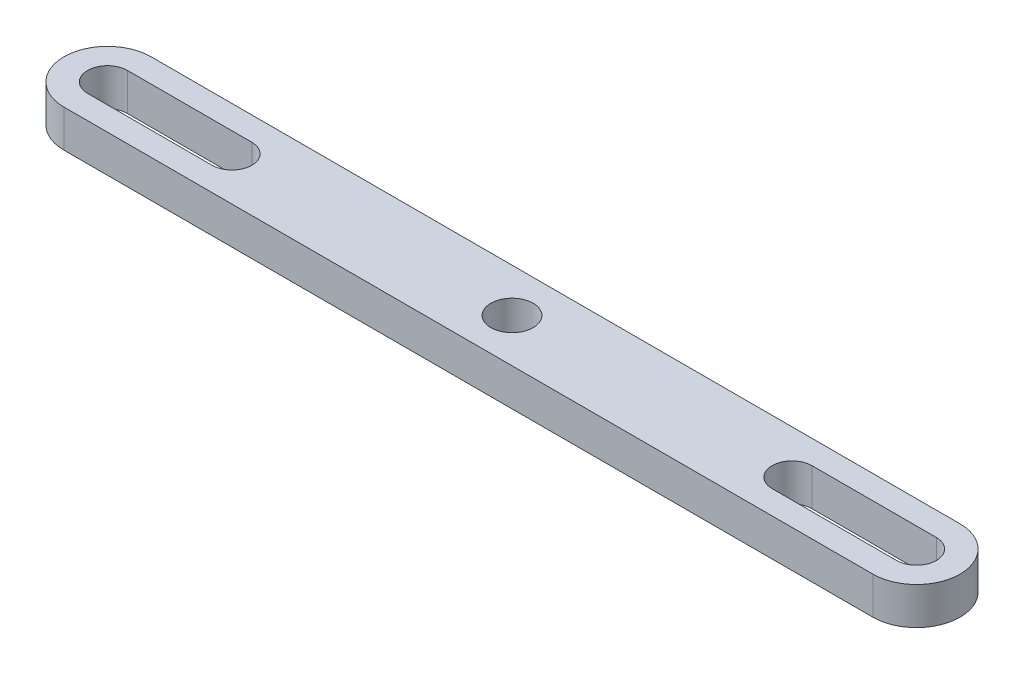
ISO-10303-21;
HEADER;
FILE_DESCRIPTION(('STEP AP214'),'2;1');
FILE_NAME('part.step','',(''),(''),'','','');
FILE_SCHEMA(('AUTOMOTIVE_DESIGN { 1 0 10303 214 1 1 1 1 }'));
ENDSEC;
DATA;
#1=APPLICATION_CONTEXT('core data for automotive mechanical design processes');
#2=APPLICATION_PROTOCOL_DEFINITION('international standard','automotive_design',2000,#1);
#3=PRODUCT_CONTEXT('',#1,'mechanical');
#4=PRODUCT('Part','Part','',(#3));
#5=PRODUCT_RELATED_PRODUCT_CATEGORY('part','',(#4));
#6=PRODUCT_DEFINITION_FORMATION('','',#4);
#7=PRODUCT_DEFINITION_CONTEXT('part definition',#1,'design');
#8=PRODUCT_DEFINITION('design','',#6,#7);
#9=PRODUCT_DEFINITION_SHAPE('','',#8);
#10=(LENGTH_UNIT() NAMED_UNIT(*) SI_UNIT(.MILLI.,.METRE.));
#11=(NAMED_UNIT(*) PLANE_ANGLE_UNIT() SI_UNIT($,.RADIAN.));
#12=(NAMED_UNIT(*) SI_UNIT($,.STERADIAN.) SOLID_ANGLE_UNIT());
#13=UNCERTAINTY_MEASURE_WITH_UNIT(LENGTH_MEASURE(1.E-05),#10,'distance_accuracy_value','');
#14=(GEOMETRIC_REPRESENTATION_CONTEXT(3) GLOBAL_UNCERTAINTY_ASSIGNED_CONTEXT((#13)) GLOBAL_UNIT_ASSIGNED_CONTEXT((#10,
#11,#12)) REPRESENTATION_CONTEXT('',''));
#15=CARTESIAN_POINT('',(0.,0.,0.));
#16=DIRECTION('',(0.,0.,1.));
#17=DIRECTION('',(1.,0.,0.));
#18=AXIS2_PLACEMENT_3D('',#15,#16,#17);
#19=CARTESIAN_POINT('',(-32.5,3.,0.));
#20=DIRECTION('',(0.,1.,0.));
#21=DIRECTION('',(0.,0.,1.));
#22=AXIS2_PLACEMENT_3D('',#19,#20,#21);
#23=PLANE('',#22);
#24=CARTESIAN_POINT('',(-32.5,3.,0.));
#25=DIRECTION('',(0.,1.,0.));
#26=DIRECTION('',(0.,0.,1.));
#27=AXIS2_PLACEMENT_3D('',#24,#25,#26);
#28=CIRCLE('',#27,3.5);
#29=CARTESIAN_POINT('',(-32.5,3.,-3.5));
#30=VERTEX_POINT('',#29);
#31=CARTESIAN_POINT('',(-32.5,3.,3.5));
#32=VERTEX_POINT('',#31);
#33=EDGE_CURVE('E197',#30,#32,#28,.T.);
#34=ORIENTED_EDGE('',*,*,#33,.T.);
#35=DIRECTION('',(1.,0.,0.));
#36=VECTOR('',#35,1.);
#37=CARTESIAN_POINT('',(-32.5,3.,3.5));
#38=LINE('',#37,#36);
#39=CARTESIAN_POINT('',(32.5,3.,3.5));
#40=VERTEX_POINT('',#39);
#41=EDGE_CURVE('E200',#32,#40,#38,.T.);
#42=ORIENTED_EDGE('',*,*,#41,.T.);
#43=CARTESIAN_POINT('',(32.5,3.,0.));
#44=DIRECTION('',(0.,1.,0.));
#45=DIRECTION('',(0.,0.,1.));
#46=AXIS2_PLACEMENT_3D('',#43,#44,#45);
#47=CIRCLE('',#46,3.5);
#48=CARTESIAN_POINT('',(32.5,3.,-3.5));
#49=VERTEX_POINT('',#48);
#50=EDGE_CURVE('E203',#40,#49,#47,.T.);
#51=ORIENTED_EDGE('',*,*,#50,.T.);
#52=DIRECTION('',(-1.,0.,0.));
#53=VECTOR('',#52,1.);
#54=CARTESIAN_POINT('',(-32.5,3.,-3.5));
#55=LINE('',#54,#53);
#56=EDGE_CURVE('E205',#49,#30,#55,.T.);
#57=ORIENTED_EDGE('',*,*,#56,.T.);
#58=EDGE_LOOP('',(#34,#42,#51,#57));
#59=FACE_BOUND('',#58,.T.);
#60=CARTESIAN_POINT('',(0.,3.,0.));
#61=DIRECTION('',(0.,1.,0.));
#62=DIRECTION('',(0.,0.,1.));
#63=AXIS2_PLACEMENT_3D('',#60,#61,#62);
#64=CIRCLE('',#63,1.7);
#65=CARTESIAN_POINT('',(0.,3.,1.7));
#66=VERTEX_POINT('',#65);
#67=EDGE_CURVE('E191',#66,#66,#64,.T.);
#68=ORIENTED_EDGE('',*,*,#67,.F.);
#69=EDGE_LOOP('',(#68));
#70=FACE_BOUND('',#69,.T.);
#71=DIRECTION('',(1.,0.,0.));
#72=VECTOR('',#71,1.);
#73=CARTESIAN_POINT('',(22.5,3.,1.6));
#74=LINE('',#73,#72);
#75=CARTESIAN_POINT('',(22.5,3.,1.6));
#76=VERTEX_POINT('',#75);
#77=CARTESIAN_POINT('',(32.5,3.,1.60000000000001));
#78=VERTEX_POINT('',#77);
#79=EDGE_CURVE('E162',#76,#78,#74,.T.);
#80=ORIENTED_EDGE('',*,*,#79,.F.);
#81=CARTESIAN_POINT('',(22.5,3.,0.));
#82=DIRECTION('',(0.,1.,0.));
#83=DIRECTION('',(0.,0.,1.));
#84=AXIS2_PLACEMENT_3D('',#81,#82,#83);
#85=CIRCLE('',#84,1.6);
#86=CARTESIAN_POINT('',(22.5,3.,-1.6));
#87=VERTEX_POINT('',#86);
#88=EDGE_CURVE('E160',#87,#76,#85,.T.);
#89=ORIENTED_EDGE('',*,*,#88,.F.);
#90=DIRECTION('',(-1.,0.,0.));
#91=VECTOR('',#90,1.);
#92=CARTESIAN_POINT('',(22.5,3.,-1.6));
#93=LINE('',#92,#91);
#94=CARTESIAN_POINT('',(32.5,3.,-1.60000000000001));
#95=VERTEX_POINT('',#94);
#96=EDGE_CURVE('E168',#95,#87,#93,.T.);
#97=ORIENTED_EDGE('',*,*,#96,.F.);
#98=CARTESIAN_POINT('',(32.5,3.,0.));
#99=DIRECTION('',(0.,1.,0.));
#100=DIRECTION('',(0.,0.,1.));
#101=AXIS2_PLACEMENT_3D('',#98,#99,#100);
#102=CIRCLE('',#101,1.60000000000001);
#103=EDGE_CURVE('E165',#78,#95,#102,.T.);
#104=ORIENTED_EDGE('',*,*,#103,.F.);
#105=EDGE_LOOP('',(#80,#89,#97,#104));
#106=FACE_BOUND('',#105,.T.);
#107=DIRECTION('',(1.,0.,0.));
#108=VECTOR('',#107,1.);
#109=CARTESIAN_POINT('',(-32.5,3.,1.6));
#110=LINE('',#109,#108);
#111=CARTESIAN_POINT('',(-32.5,3.,1.6));
#112=VERTEX_POINT('',#111);
#113=CARTESIAN_POINT('',(-22.5,3.,1.6));
#114=VERTEX_POINT('',#113);
#115=EDGE_CURVE('E132',#112,#114,#110,.T.);
#116=ORIENTED_EDGE('',*,*,#115,.F.);
#117=CARTESIAN_POINT('',(-32.5,3.,0.));
#118=DIRECTION('',(0.,1.,0.));
#119=DIRECTION('',(0.,0.,1.));
#120=AXIS2_PLACEMENT_3D('',#117,#118,#119);
#121=CIRCLE('',#120,1.6);
#122=CARTESIAN_POINT('',(-32.5,3.,-1.6));
#123=VERTEX_POINT('',#122);
#124=EDGE_CURVE('E124',#123,#112,#121,.T.);
#125=ORIENTED_EDGE('',*,*,#124,.F.);
#126=DIRECTION('',(-1.,0.,0.));
#127=VECTOR('',#126,1.);
#128=CARTESIAN_POINT('',(-32.5,3.,-1.6));
#129=LINE('',#128,#127);
#130=CARTESIAN_POINT('',(-22.5,3.,-1.6));
#131=VERTEX_POINT('',#130);
#132=EDGE_CURVE('E146',#131,#123,#129,.T.);
#133=ORIENTED_EDGE('',*,*,#132,.F.);
#134=CARTESIAN_POINT('',(-22.5,3.,0.));
#135=DIRECTION('',(0.,1.,0.));
#136=DIRECTION('',(0.,0.,1.));
#137=AXIS2_PLACEMENT_3D('',#134,#135,#136);
#138=CIRCLE('',#137,1.6);
#139=EDGE_CURVE('E144',#114,#131,#138,.T.);
#140=ORIENTED_EDGE('',*,*,#139,.F.);
#141=EDGE_LOOP('',(#116,#125,#133,#140));
#142=FACE_BOUND('',#141,.T.);
#143=ADVANCED_FACE('F35',(#59,#70,#106,#142),#23,.T.);
#144=CARTESIAN_POINT('',(-32.5,0.,0.));
#145=DIRECTION('',(0.,1.,0.));
#146=DIRECTION('',(0.,0.,1.));
#147=AXIS2_PLACEMENT_3D('',#144,#145,#146);
#148=PLANE('',#147);
#149=CARTESIAN_POINT('',(22.5,0.,0.));
#150=DIRECTION('',(0.,1.,0.));
#151=DIRECTION('',(0.,0.,1.));
#152=AXIS2_PLACEMENT_3D('',#149,#150,#151);
#153=CIRCLE('',#152,1.6);
#154=CARTESIAN_POINT('',(22.5,0.,-1.6));
#155=VERTEX_POINT('',#154);
#156=CARTESIAN_POINT('',(22.5,0.,1.6));
#157=VERTEX_POINT('',#156);
#158=EDGE_CURVE('E140',#155,#157,#153,.T.);
#159=ORIENTED_EDGE('',*,*,#158,.T.);
#160=DIRECTION('',(1.,0.,0.));
#161=VECTOR('',#160,1.);
#162=CARTESIAN_POINT('',(22.5,0.,1.6));
#163=LINE('',#162,#161);
#164=CARTESIAN_POINT('',(32.5,0.,1.60000000000001));
#165=VERTEX_POINT('',#164);
#166=EDGE_CURVE('E173',#157,#165,#163,.T.);
#167=ORIENTED_EDGE('',*,*,#166,.T.);
#168=CARTESIAN_POINT('',(32.5,0.,0.));
#169=DIRECTION('',(0.,1.,0.));
#170=DIRECTION('',(0.,0.,1.));
#171=AXIS2_PLACEMENT_3D('',#168,#169,#170);
#172=CIRCLE('',#171,1.60000000000001);
#173=CARTESIAN_POINT('',(32.5,0.,-1.60000000000001));
#174=VERTEX_POINT('',#173);
#175=EDGE_CURVE('E176',#165,#174,#172,.T.);
#176=ORIENTED_EDGE('',*,*,#175,.T.);
#177=DIRECTION('',(-1.,0.,0.));
#178=VECTOR('',#177,1.);
#179=CARTESIAN_POINT('',(22.5,0.,-1.6));
#180=LINE('',#179,#178);
#181=EDGE_CURVE('E163',#174,#155,#180,.T.);
#182=ORIENTED_EDGE('',*,*,#181,.T.);
#183=EDGE_LOOP('',(#159,#167,#176,#182));
#184=FACE_BOUND('',#183,.T.);
#185=CARTESIAN_POINT('',(-32.5,0.,0.));
#186=DIRECTION('',(0.,1.,0.));
#187=DIRECTION('',(0.,0.,1.));
#188=AXIS2_PLACEMENT_3D('',#185,#186,#187);
#189=CIRCLE('',#188,3.5);
#190=CARTESIAN_POINT('',(-32.5,0.,-3.5));
#191=VERTEX_POINT('',#190);
#192=CARTESIAN_POINT('',(-32.5,0.,3.5));
#193=VERTEX_POINT('',#192);
#194=EDGE_CURVE('E194',#191,#193,#189,.T.);
#195=ORIENTED_EDGE('',*,*,#194,.F.);
#196=DIRECTION('',(-1.,0.,0.));
#197=VECTOR('',#196,1.);
#198=CARTESIAN_POINT('',(-32.5,0.,-3.5));
#199=LINE('',#198,#197);
#200=CARTESIAN_POINT('',(32.5,0.,-3.5));
#201=VERTEX_POINT('',#200);
#202=EDGE_CURVE('E201',#201,#191,#199,.T.);
#203=ORIENTED_EDGE('',*,*,#202,.F.);
#204=CARTESIAN_POINT('',(32.5,0.,0.));
#205=DIRECTION('',(0.,1.,0.));
#206=DIRECTION('',(0.,0.,1.));
#207=AXIS2_PLACEMENT_3D('',#204,#205,#206);
#208=CIRCLE('',#207,3.5);
#209=CARTESIAN_POINT('',(32.5,0.,3.5));
#210=VERTEX_POINT('',#209);
#211=EDGE_CURVE('E212',#210,#201,#208,.T.);
#212=ORIENTED_EDGE('',*,*,#211,.F.);
#213=DIRECTION('',(1.,0.,0.));
#214=VECTOR('',#213,1.);
#215=CARTESIAN_POINT('',(-32.5,0.,3.5));
#216=LINE('',#215,#214);
#217=EDGE_CURVE('E210',#193,#210,#216,.T.);
#218=ORIENTED_EDGE('',*,*,#217,.F.);
#219=EDGE_LOOP('',(#195,#203,#212,#218));
#220=FACE_BOUND('',#219,.T.);
#221=CARTESIAN_POINT('',(0.,0.,0.));
#222=DIRECTION('',(0.,1.,0.));
#223=DIRECTION('',(0.,0.,1.));
#224=AXIS2_PLACEMENT_3D('',#221,#222,#223);
#225=CIRCLE('',#224,1.7);
#226=CARTESIAN_POINT('',(0.,0.,1.7));
#227=VERTEX_POINT('',#226);
#228=EDGE_CURVE('E190',#227,#227,#225,.T.);
#229=ORIENTED_EDGE('',*,*,#228,.T.);
#230=EDGE_LOOP('',(#229));
#231=FACE_BOUND('',#230,.T.);
#232=CARTESIAN_POINT('',(-32.5,0.,0.));
#233=DIRECTION('',(0.,1.,0.));
#234=DIRECTION('',(0.,0.,1.));
#235=AXIS2_PLACEMENT_3D('',#232,#233,#234);
#236=CIRCLE('',#235,1.6);
#237=CARTESIAN_POINT('',(-32.5,0.,-1.6));
#238=VERTEX_POINT('',#237);
#239=CARTESIAN_POINT('',(-32.5,0.,1.6));
#240=VERTEX_POINT('',#239);
#241=EDGE_CURVE('E58',#238,#240,#236,.T.);
#242=ORIENTED_EDGE('',*,*,#241,.T.);
#243=DIRECTION('',(1.,0.,0.));
#244=VECTOR('',#243,1.);
#245=CARTESIAN_POINT('',(-32.5,0.,1.6));
#246=LINE('',#245,#244);
#247=CARTESIAN_POINT('',(-22.5,0.,1.6));
#248=VERTEX_POINT('',#247);
#249=EDGE_CURVE('E139',#240,#248,#246,.T.);
#250=ORIENTED_EDGE('',*,*,#249,.T.);
#251=CARTESIAN_POINT('',(-22.5,0.,0.));
#252=DIRECTION('',(0.,1.,0.));
#253=DIRECTION('',(0.,0.,1.));
#254=AXIS2_PLACEMENT_3D('',#251,#252,#253);
#255=CIRCLE('',#254,1.6);
#256=CARTESIAN_POINT('',(-22.5,0.,-1.6));
#257=VERTEX_POINT('',#256);
#258=EDGE_CURVE('E152',#248,#257,#255,.T.);
#259=ORIENTED_EDGE('',*,*,#258,.T.);
#260=DIRECTION('',(-1.,0.,0.));
#261=VECTOR('',#260,1.);
#262=CARTESIAN_POINT('',(-32.5,0.,-1.6));
#263=LINE('',#262,#261);
#264=EDGE_CURVE('E133',#257,#238,#263,.T.);
#265=ORIENTED_EDGE('',*,*,#264,.T.);
#266=EDGE_LOOP('',(#242,#250,#259,#265));
#267=FACE_BOUND('',#266,.T.);
#268=ADVANCED_FACE('F230',(#184,#220,#231,#267),#148,.F.);
#269=CARTESIAN_POINT('',(-32.5,3.,0.));
#270=DIRECTION('',(0.,-1.,0.));
#271=DIRECTION('',(0.,0.,-1.));
#272=AXIS2_PLACEMENT_3D('',#269,#270,#271);
#273=CYLINDRICAL_SURFACE('',#272,3.5);
#274=ORIENTED_EDGE('',*,*,#194,.T.);
#275=DIRECTION('',(0.,-1.,0.));
#276=VECTOR('',#275,1.);
#277=CARTESIAN_POINT('',(-32.5,3.,3.5));
#278=LINE('',#277,#276);
#279=EDGE_CURVE('E11',#32,#193,#278,.T.);
#280=ORIENTED_EDGE('',*,*,#279,.F.);
#281=ORIENTED_EDGE('',*,*,#33,.F.);
#282=DIRECTION('',(0.,-1.,0.));
#283=VECTOR('',#282,1.);
#284=CARTESIAN_POINT('',(-32.5,3.,-3.5));
#285=LINE('',#284,#283);
#286=EDGE_CURVE('E207',#30,#191,#285,.T.);
#287=ORIENTED_EDGE('',*,*,#286,.T.);
#288=EDGE_LOOP('',(#274,#280,#281,#287));
#289=FACE_BOUND('',#288,.T.);
#290=ADVANCED_FACE('F37',(#289),#273,.T.);
#291=CARTESIAN_POINT('',(-32.5,3.,3.5));
#292=DIRECTION('',(0.,0.,-1.));
#293=DIRECTION('',(-1.,0.,0.));
#294=AXIS2_PLACEMENT_3D('',#291,#292,#293);
#295=PLANE('',#294);
#296=ORIENTED_EDGE('',*,*,#217,.T.);
#297=DIRECTION('',(0.,-1.,0.));
#298=VECTOR('',#297,1.);
#299=CARTESIAN_POINT('',(32.5,3.,3.5));
#300=LINE('',#299,#298);
#301=EDGE_CURVE('E43',#40,#210,#300,.T.);
#302=ORIENTED_EDGE('',*,*,#301,.F.);
#303=ORIENTED_EDGE('',*,*,#41,.F.);
#304=ORIENTED_EDGE('',*,*,#279,.T.);
#305=EDGE_LOOP('',(#296,#302,#303,#304));
#306=FACE_BOUND('',#305,.T.);
#307=ADVANCED_FACE('F241',(#306),#295,.F.);
#308=CARTESIAN_POINT('',(32.5,3.,0.));
#309=DIRECTION('',(0.,-1.,0.));
#310=DIRECTION('',(0.,0.,-1.));
#311=AXIS2_PLACEMENT_3D('',#308,#309,#310);
#312=CYLINDRICAL_SURFACE('',#311,3.5);
#313=ORIENTED_EDGE('',*,*,#211,.T.);
#314=DIRECTION('',(0.,-1.,0.));
#315=VECTOR('',#314,1.);
#316=CARTESIAN_POINT('',(32.5,3.,-3.5));
#317=LINE('',#316,#315);
#318=EDGE_CURVE('E217',#49,#201,#317,.T.);
#319=ORIENTED_EDGE('',*,*,#318,.F.);
#320=ORIENTED_EDGE('',*,*,#50,.F.);
#321=ORIENTED_EDGE('',*,*,#301,.T.);
#322=EDGE_LOOP('',(#313,#319,#320,#321));
#323=FACE_BOUND('',#322,.T.);
#324=ADVANCED_FACE('F224',(#323),#312,.T.);
#325=CARTESIAN_POINT('',(-32.5,3.,-3.5));
#326=DIRECTION('',(0.,0.,1.));
#327=DIRECTION('',(1.,0.,0.));
#328=AXIS2_PLACEMENT_3D('',#325,#326,#327);
#329=PLANE('',#328);
#330=ORIENTED_EDGE('',*,*,#202,.T.);
#331=ORIENTED_EDGE('',*,*,#286,.F.);
#332=ORIENTED_EDGE('',*,*,#56,.F.);
#333=ORIENTED_EDGE('',*,*,#318,.T.);
#334=EDGE_LOOP('',(#330,#331,#332,#333));
#335=FACE_BOUND('',#334,.T.);
#336=ADVANCED_FACE('F234',(#335),#329,.F.);
#337=CARTESIAN_POINT('',(0.,3.,0.));
#338=DIRECTION('',(0.,-1.,0.));
#339=DIRECTION('',(0.,0.,-1.));
#340=AXIS2_PLACEMENT_3D('',#337,#338,#339);
#341=CYLINDRICAL_SURFACE('',#340,1.7);
#342=ORIENTED_EDGE('',*,*,#67,.T.);
#343=EDGE_LOOP('',(#342));
#344=FACE_BOUND('',#343,.T.);
#345=ORIENTED_EDGE('',*,*,#228,.F.);
#346=EDGE_LOOP('',(#345));
#347=FACE_BOUND('',#346,.T.);
#348=ADVANCED_FACE('F256',(#344,#347),#341,.F.);
#349=CARTESIAN_POINT('',(22.5,3.,0.));
#350=DIRECTION('',(0.,-1.,0.));
#351=DIRECTION('',(0.,0.,-1.));
#352=AXIS2_PLACEMENT_3D('',#349,#350,#351);
#353=CYLINDRICAL_SURFACE('',#352,1.6);
#354=ORIENTED_EDGE('',*,*,#158,.F.);
#355=DIRECTION('',(0.,-1.,0.));
#356=VECTOR('',#355,1.);
#357=CARTESIAN_POINT('',(22.5,3.,-1.6));
#358=LINE('',#357,#356);
#359=EDGE_CURVE('E170',#87,#155,#358,.T.);
#360=ORIENTED_EDGE('',*,*,#359,.F.);
#361=ORIENTED_EDGE('',*,*,#88,.T.);
#362=DIRECTION('',(0.,-1.,0.));
#363=VECTOR('',#362,1.);
#364=CARTESIAN_POINT('',(22.5,3.,1.6));
#365=LINE('',#364,#363);
#366=EDGE_CURVE('E187',#76,#157,#365,.T.);
#367=ORIENTED_EDGE('',*,*,#366,.T.);
#368=EDGE_LOOP('',(#354,#360,#361,#367));
#369=FACE_BOUND('',#368,.T.);
#370=ADVANCED_FACE('F263',(#369),#353,.F.);
#371=CARTESIAN_POINT('',(22.5,3.,1.6));
#372=DIRECTION('',(0.,0.,-1.));
#373=DIRECTION('',(-1.,0.,0.));
#374=AXIS2_PLACEMENT_3D('',#371,#372,#373);
#375=PLANE('',#374);
#376=ORIENTED_EDGE('',*,*,#166,.F.);
#377=ORIENTED_EDGE('',*,*,#366,.F.);
#378=ORIENTED_EDGE('',*,*,#79,.T.);
#379=DIRECTION('',(0.,-1.,0.));
#380=VECTOR('',#379,1.);
#381=CARTESIAN_POINT('',(32.5,3.,1.60000000000001));
#382=LINE('',#381,#380);
#383=EDGE_CURVE('E185',#78,#165,#382,.T.);
#384=ORIENTED_EDGE('',*,*,#383,.T.);
#385=EDGE_LOOP('',(#376,#377,#378,#384));
#386=FACE_BOUND('',#385,.T.);
#387=ADVANCED_FACE('F268',(#386),#375,.T.);
#388=CARTESIAN_POINT('',(32.5,3.,0.));
#389=DIRECTION('',(0.,-1.,0.));
#390=DIRECTION('',(0.,0.,-1.));
#391=AXIS2_PLACEMENT_3D('',#388,#389,#390);
#392=CYLINDRICAL_SURFACE('',#391,1.60000000000001);
#393=ORIENTED_EDGE('',*,*,#175,.F.);
#394=ORIENTED_EDGE('',*,*,#383,.F.);
#395=ORIENTED_EDGE('',*,*,#103,.T.);
#396=DIRECTION('',(0.,-1.,0.));
#397=VECTOR('',#396,1.);
#398=CARTESIAN_POINT('',(32.5,3.,-1.60000000000001));
#399=LINE('',#398,#397);
#400=EDGE_CURVE('E183',#95,#174,#399,.T.);
#401=ORIENTED_EDGE('',*,*,#400,.T.);
#402=EDGE_LOOP('',(#393,#394,#395,#401));
#403=FACE_BOUND('',#402,.T.);
#404=ADVANCED_FACE('F292',(#403),#392,.F.);
#405=CARTESIAN_POINT('',(22.5,3.,-1.6));
#406=DIRECTION('',(0.,0.,1.));
#407=DIRECTION('',(1.,0.,0.));
#408=AXIS2_PLACEMENT_3D('',#405,#406,#407);
#409=PLANE('',#408);
#410=ORIENTED_EDGE('',*,*,#181,.F.);
#411=ORIENTED_EDGE('',*,*,#400,.F.);
#412=ORIENTED_EDGE('',*,*,#96,.T.);
#413=ORIENTED_EDGE('',*,*,#359,.T.);
#414=EDGE_LOOP('',(#410,#411,#412,#413));
#415=FACE_BOUND('',#414,.T.);
#416=ADVANCED_FACE('F289',(#415),#409,.T.);
#417=CARTESIAN_POINT('',(-32.5,3.,0.));
#418=DIRECTION('',(0.,-1.,0.));
#419=DIRECTION('',(0.,0.,-1.));
#420=AXIS2_PLACEMENT_3D('',#417,#418,#419);
#421=CYLINDRICAL_SURFACE('',#420,1.6);
#422=ORIENTED_EDGE('',*,*,#241,.F.);
#423=DIRECTION('',(0.,-1.,0.));
#424=VECTOR('',#423,1.);
#425=CARTESIAN_POINT('',(-32.5,3.,-1.6));
#426=LINE('',#425,#424);
#427=EDGE_CURVE('E128',#123,#238,#426,.T.);
#428=ORIENTED_EDGE('',*,*,#427,.F.);
#429=ORIENTED_EDGE('',*,*,#124,.T.);
#430=DIRECTION('',(0.,-1.,0.));
#431=VECTOR('',#430,1.);
#432=CARTESIAN_POINT('',(-32.5,3.,1.6));
#433=LINE('',#432,#431);
#434=EDGE_CURVE('E127',#112,#240,#433,.T.);
#435=ORIENTED_EDGE('',*,*,#434,.T.);
#436=EDGE_LOOP('',(#422,#428,#429,#435));
#437=FACE_BOUND('',#436,.T.);
#438=ADVANCED_FACE('F126',(#437),#421,.F.);
#439=CARTESIAN_POINT('',(-32.5,3.,1.6));
#440=DIRECTION('',(0.,0.,-1.));
#441=DIRECTION('',(-1.,0.,0.));
#442=AXIS2_PLACEMENT_3D('',#439,#440,#441);
#443=PLANE('',#442);
#444=ORIENTED_EDGE('',*,*,#249,.F.);
#445=ORIENTED_EDGE('',*,*,#434,.F.);
#446=ORIENTED_EDGE('',*,*,#115,.T.);
#447=DIRECTION('',(0.,-1.,0.));
#448=VECTOR('',#447,1.);
#449=CARTESIAN_POINT('',(-22.5,3.,1.6));
#450=LINE('',#449,#448);
#451=EDGE_CURVE('E141',#114,#248,#450,.T.);
#452=ORIENTED_EDGE('',*,*,#451,.T.);
#453=EDGE_LOOP('',(#444,#445,#446,#452));
#454=FACE_BOUND('',#453,.T.);
#455=ADVANCED_FACE('F136',(#454),#443,.T.);
#456=CARTESIAN_POINT('',(-22.5,3.,0.));
#457=DIRECTION('',(0.,-1.,0.));
#458=DIRECTION('',(0.,0.,-1.));
#459=AXIS2_PLACEMENT_3D('',#456,#457,#458);
#460=CYLINDRICAL_SURFACE('',#459,1.6);
#461=ORIENTED_EDGE('',*,*,#258,.F.);
#462=ORIENTED_EDGE('',*,*,#451,.F.);
#463=ORIENTED_EDGE('',*,*,#139,.T.);
#464=DIRECTION('',(0.,-1.,0.));
#465=VECTOR('',#464,1.);
#466=CARTESIAN_POINT('',(-22.5,3.,-1.6));
#467=LINE('',#466,#465);
#468=EDGE_CURVE('E50',#131,#257,#467,.T.);
#469=ORIENTED_EDGE('',*,*,#468,.T.);
#470=EDGE_LOOP('',(#461,#462,#463,#469));
#471=FACE_BOUND('',#470,.T.);
#472=ADVANCED_FACE('F277',(#471),#460,.F.);
#473=CARTESIAN_POINT('',(-32.5,3.,-1.6));
#474=DIRECTION('',(0.,0.,1.));
#475=DIRECTION('',(1.,0.,0.));
#476=AXIS2_PLACEMENT_3D('',#473,#474,#475);
#477=PLANE('',#476);
#478=ORIENTED_EDGE('',*,*,#264,.F.);
#479=ORIENTED_EDGE('',*,*,#468,.F.);
#480=ORIENTED_EDGE('',*,*,#132,.T.);
#481=ORIENTED_EDGE('',*,*,#427,.T.);
#482=EDGE_LOOP('',(#478,#479,#480,#481));
#483=FACE_BOUND('',#482,.T.);
#484=ADVANCED_FACE('F275',(#483),#477,.T.);
#485=CLOSED_SHELL('',(#143,#268,#290,#307,#324,#336,#348,#370,#387,#404,#416,#438,#455,#472,#484));
#486=MANIFOLD_SOLID_BREP('B2',#485);
#487=ADVANCED_BREP_SHAPE_REPRESENTATION('',(#18,#486),#14);
#488=SHAPE_DEFINITION_REPRESENTATION(#9,#487);
ENDSEC;
END-ISO-10303-21;
